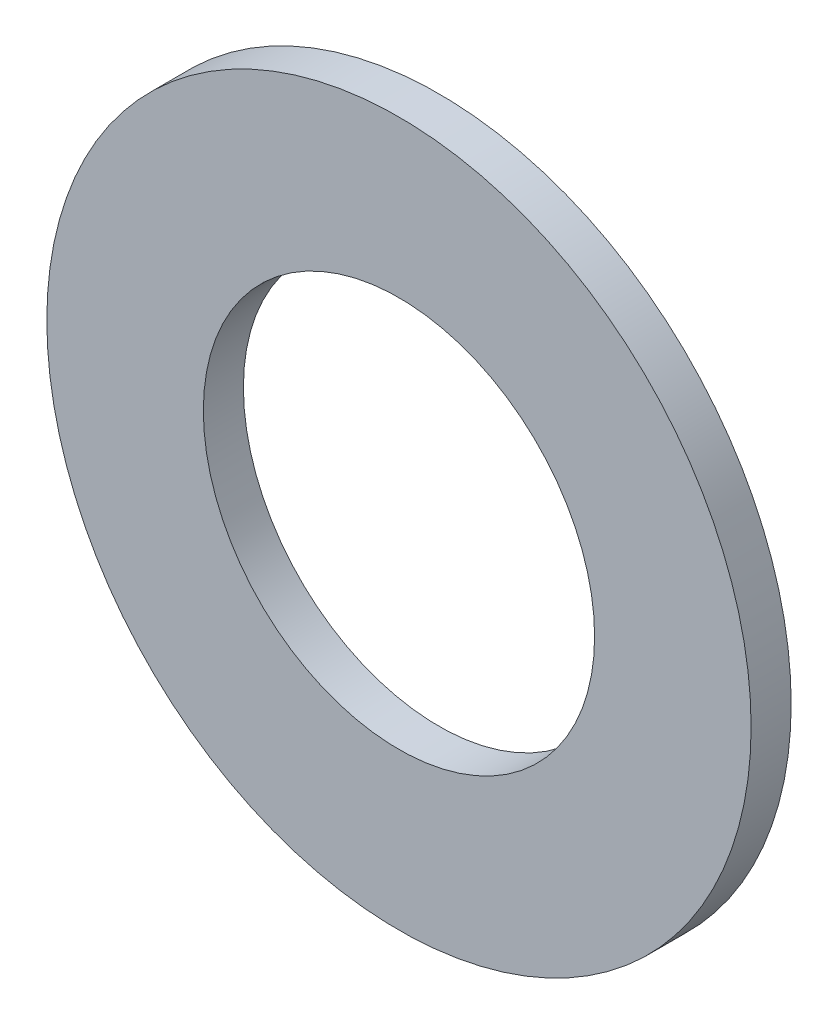
ISO-10303-21;
HEADER;
FILE_DESCRIPTION(('STEP AP214'),'2;1');
FILE_NAME('part.step','',(''),(''),'','','');
FILE_SCHEMA(('AUTOMOTIVE_DESIGN { 1 0 10303 214 1 1 1 1 }'));
ENDSEC;
DATA;
#1=APPLICATION_CONTEXT('core data for automotive mechanical design processes');
#2=APPLICATION_PROTOCOL_DEFINITION('international standard','automotive_design',2000,#1);
#3=PRODUCT_CONTEXT('',#1,'mechanical');
#4=PRODUCT('Part','Part','',(#3));
#5=PRODUCT_RELATED_PRODUCT_CATEGORY('part','',(#4));
#6=PRODUCT_DEFINITION_FORMATION('','',#4);
#7=PRODUCT_DEFINITION_CONTEXT('part definition',#1,'design');
#8=PRODUCT_DEFINITION('design','',#6,#7);
#9=PRODUCT_DEFINITION_SHAPE('','',#8);
#10=(LENGTH_UNIT() NAMED_UNIT(*) SI_UNIT(.MILLI.,.METRE.));
#11=(NAMED_UNIT(*) PLANE_ANGLE_UNIT() SI_UNIT($,.RADIAN.));
#12=(NAMED_UNIT(*) SI_UNIT($,.STERADIAN.) SOLID_ANGLE_UNIT());
#13=UNCERTAINTY_MEASURE_WITH_UNIT(LENGTH_MEASURE(1.E-05),#10,'distance_accuracy_value','');
#14=(GEOMETRIC_REPRESENTATION_CONTEXT(3) GLOBAL_UNCERTAINTY_ASSIGNED_CONTEXT((#13)) GLOBAL_UNIT_ASSIGNED_CONTEXT((#10,
#11,#12)) REPRESENTATION_CONTEXT('',''));
#15=CARTESIAN_POINT('',(0.,0.,0.));
#16=DIRECTION('',(0.,0.,1.));
#17=DIRECTION('',(1.,0.,0.));
#18=AXIS2_PLACEMENT_3D('',#15,#16,#17);
#19=CARTESIAN_POINT('',(0.,0.,0.8128));
#20=DIRECTION('',(0.,0.,1.));
#21=DIRECTION('',(1.,0.,0.));
#22=AXIS2_PLACEMENT_3D('',#19,#20,#21);
#23=PLANE('',#22);
#24=CARTESIAN_POINT('',(0.,0.,0.8128));
#25=DIRECTION('',(0.,0.,1.));
#26=DIRECTION('',(1.,0.,0.));
#27=AXIS2_PLACEMENT_3D('',#24,#25,#26);
#28=CIRCLE('',#27,7.14375);
#29=CARTESIAN_POINT('',(7.14375,0.,0.8128));
#30=VERTEX_POINT('',#29);
#31=EDGE_CURVE('E10',#30,#30,#28,.T.);
#32=ORIENTED_EDGE('',*,*,#31,.T.);
#33=EDGE_LOOP('',(#32));
#34=FACE_BOUND('',#33,.T.);
#35=CARTESIAN_POINT('',(0.,0.,0.8128));
#36=DIRECTION('',(0.,0.,1.));
#37=DIRECTION('',(1.,0.,0.));
#38=AXIS2_PLACEMENT_3D('',#35,#36,#37);
#39=CIRCLE('',#38,3.96875);
#40=CARTESIAN_POINT('',(3.96875,0.,0.8128));
#41=VERTEX_POINT('',#40);
#42=EDGE_CURVE('E47',#41,#41,#39,.T.);
#43=ORIENTED_EDGE('',*,*,#42,.F.);
#44=EDGE_LOOP('',(#43));
#45=FACE_BOUND('',#44,.T.);
#46=ADVANCED_FACE('F36',(#34,#45),#23,.T.);
#47=CARTESIAN_POINT('',(0.,0.,0.));
#48=DIRECTION('',(0.,0.,1.));
#49=DIRECTION('',(1.,0.,0.));
#50=AXIS2_PLACEMENT_3D('',#47,#48,#49);
#51=PLANE('',#50);
#52=CARTESIAN_POINT('',(0.,0.,0.));
#53=DIRECTION('',(0.,0.,1.));
#54=DIRECTION('',(1.,0.,0.));
#55=AXIS2_PLACEMENT_3D('',#52,#53,#54);
#56=CIRCLE('',#55,7.14375);
#57=CARTESIAN_POINT('',(7.14375,0.,0.));
#58=VERTEX_POINT('',#57);
#59=EDGE_CURVE('E40',#58,#58,#56,.T.);
#60=ORIENTED_EDGE('',*,*,#59,.F.);
#61=EDGE_LOOP('',(#60));
#62=FACE_BOUND('',#61,.T.);
#63=CARTESIAN_POINT('',(0.,0.,0.));
#64=DIRECTION('',(0.,0.,1.));
#65=DIRECTION('',(1.,0.,0.));
#66=AXIS2_PLACEMENT_3D('',#63,#64,#65);
#67=CIRCLE('',#66,3.96875);
#68=CARTESIAN_POINT('',(3.96875,0.,0.));
#69=VERTEX_POINT('',#68);
#70=EDGE_CURVE('E49',#69,#69,#67,.T.);
#71=ORIENTED_EDGE('',*,*,#70,.T.);
#72=EDGE_LOOP('',(#71));
#73=FACE_BOUND('',#72,.T.);
#74=ADVANCED_FACE('F59',(#62,#73),#51,.F.);
#75=CARTESIAN_POINT('',(0.,0.,0.8128));
#76=DIRECTION('',(0.,0.,-1.));
#77=DIRECTION('',(-1.,0.,0.));
#78=AXIS2_PLACEMENT_3D('',#75,#76,#77);
#79=CYLINDRICAL_SURFACE('',#78,7.14375);
#80=ORIENTED_EDGE('',*,*,#31,.F.);
#81=EDGE_LOOP('',(#80));
#82=FACE_BOUND('',#81,.T.);
#83=ORIENTED_EDGE('',*,*,#59,.T.);
#84=EDGE_LOOP('',(#83));
#85=FACE_BOUND('',#84,.T.);
#86=ADVANCED_FACE('F38',(#82,#85),#79,.T.);
#87=CARTESIAN_POINT('',(0.,0.,0.8128));
#88=DIRECTION('',(0.,0.,-1.));
#89=DIRECTION('',(-1.,0.,0.));
#90=AXIS2_PLACEMENT_3D('',#87,#88,#89);
#91=CYLINDRICAL_SURFACE('',#90,3.96875);
#92=ORIENTED_EDGE('',*,*,#42,.T.);
#93=EDGE_LOOP('',(#92));
#94=FACE_BOUND('',#93,.T.);
#95=ORIENTED_EDGE('',*,*,#70,.F.);
#96=EDGE_LOOP('',(#95));
#97=FACE_BOUND('',#96,.T.);
#98=ADVANCED_FACE('F55',(#94,#97),#91,.F.);
#99=CLOSED_SHELL('',(#46,#74,#86,#98));
#100=MANIFOLD_SOLID_BREP('B2',#99);
#101=ADVANCED_BREP_SHAPE_REPRESENTATION('',(#18,#100),#14);
#102=SHAPE_DEFINITION_REPRESENTATION(#9,#101);
ENDSEC;
END-ISO-10303-21;
